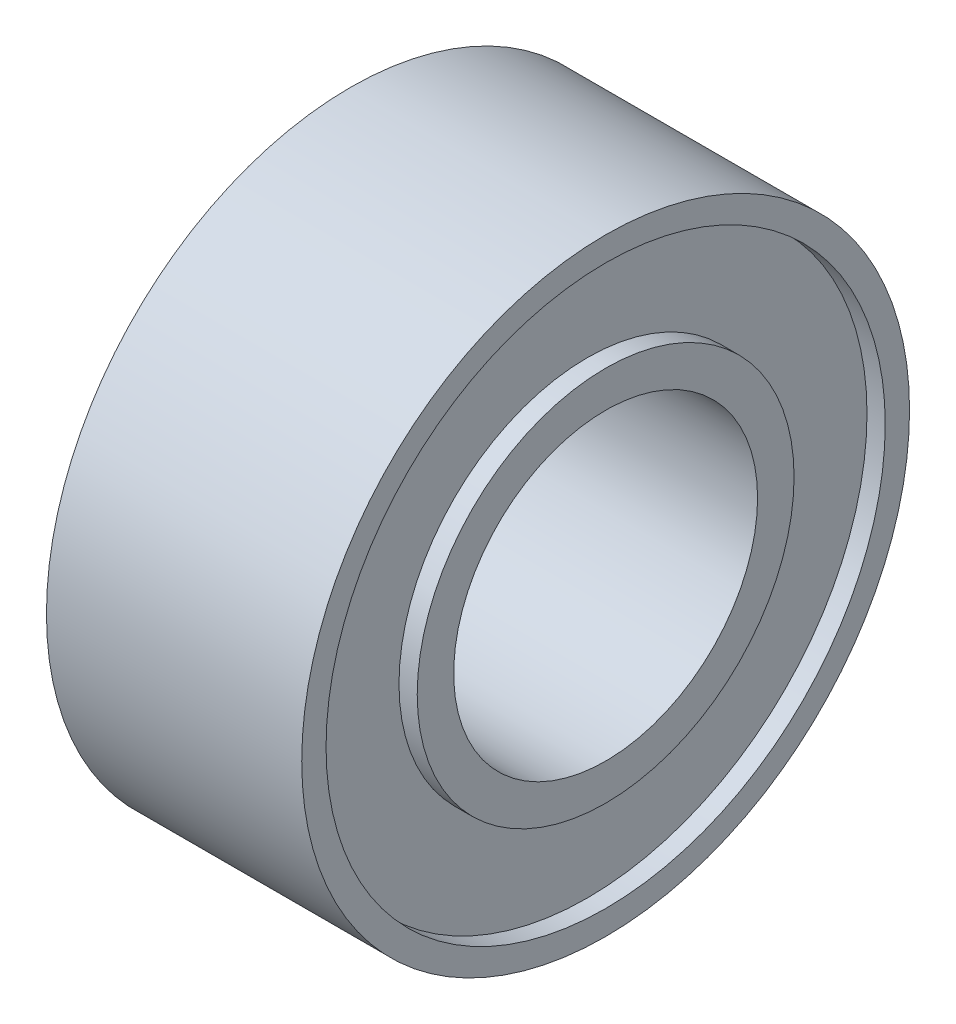
ISO-10303-21;
HEADER;
FILE_DESCRIPTION(('STEP AP214'),'2;1');
FILE_NAME('part.step','',(''),(''),'','','');
FILE_SCHEMA(('AUTOMOTIVE_DESIGN { 1 0 10303 214 1 1 1 1 }'));
ENDSEC;
DATA;
#1=APPLICATION_CONTEXT('core data for automotive mechanical design processes');
#2=APPLICATION_PROTOCOL_DEFINITION('international standard','automotive_design',2000,#1);
#3=PRODUCT_CONTEXT('',#1,'mechanical');
#4=PRODUCT('Part','Part','',(#3));
#5=PRODUCT_RELATED_PRODUCT_CATEGORY('part','',(#4));
#6=PRODUCT_DEFINITION_FORMATION('','',#4);
#7=PRODUCT_DEFINITION_CONTEXT('part definition',#1,'design');
#8=PRODUCT_DEFINITION('design','',#6,#7);
#9=PRODUCT_DEFINITION_SHAPE('','',#8);
#10=(LENGTH_UNIT() NAMED_UNIT(*) SI_UNIT(.MILLI.,.METRE.));
#11=(NAMED_UNIT(*) PLANE_ANGLE_UNIT() SI_UNIT($,.RADIAN.));
#12=(NAMED_UNIT(*) SI_UNIT($,.STERADIAN.) SOLID_ANGLE_UNIT());
#13=UNCERTAINTY_MEASURE_WITH_UNIT(LENGTH_MEASURE(1.E-05),#10,'distance_accuracy_value','');
#14=(GEOMETRIC_REPRESENTATION_CONTEXT(3) GLOBAL_UNCERTAINTY_ASSIGNED_CONTEXT((#13)) GLOBAL_UNIT_ASSIGNED_CONTEXT((#10,
#11,#12)) REPRESENTATION_CONTEXT('',''));
#15=CARTESIAN_POINT('',(0.,0.,0.));
#16=DIRECTION('',(0.,0.,1.));
#17=DIRECTION('',(1.,0.,0.));
#18=AXIS2_PLACEMENT_3D('',#15,#16,#17);
#19=CARTESIAN_POINT('',(-2.1,2.5,0.));
#20=DIRECTION('',(-1.,0.,0.));
#21=DIRECTION('',(0.,0.,1.));
#22=AXIS2_PLACEMENT_3D('',#19,#20,#21);
#23=PLANE('',#22);
#24=CARTESIAN_POINT('',(-2.1,0.,0.));
#25=DIRECTION('',(1.,0.,0.));
#26=DIRECTION('',(0.,0.,-1.));
#27=AXIS2_PLACEMENT_3D('',#24,#25,#26);
#28=CIRCLE('',#27,2.5);
#29=CARTESIAN_POINT('',(-2.1,0.,-2.5));
#30=VERTEX_POINT('',#29);
#31=EDGE_CURVE('E84',#30,#30,#28,.T.);
#32=ORIENTED_EDGE('',*,*,#31,.T.);
#33=EDGE_LOOP('',(#32));
#34=FACE_BOUND('',#33,.T.);
#35=CARTESIAN_POINT('',(-2.1,0.,0.));
#36=DIRECTION('',(1.,0.,0.));
#37=DIRECTION('',(0.,0.,-1.));
#38=AXIS2_PLACEMENT_3D('',#35,#36,#37);
#39=CIRCLE('',#38,3.1);
#40=CARTESIAN_POINT('',(-2.1,0.,-3.1));
#41=VERTEX_POINT('',#40);
#42=EDGE_CURVE('E12',#41,#41,#39,.T.);
#43=ORIENTED_EDGE('',*,*,#42,.F.);
#44=EDGE_LOOP('',(#43));
#45=FACE_BOUND('',#44,.T.);
#46=ADVANCED_FACE('F44',(#34,#45),#23,.T.);
#47=CARTESIAN_POINT('',(0.,0.,0.));
#48=DIRECTION('',(1.,0.,0.));
#49=DIRECTION('',(0.,0.,-1.));
#50=AXIS2_PLACEMENT_3D('',#47,#48,#49);
#51=CYLINDRICAL_SURFACE('',#50,3.1);
#52=ORIENTED_EDGE('',*,*,#42,.T.);
#53=EDGE_LOOP('',(#52));
#54=FACE_BOUND('',#53,.T.);
#55=CARTESIAN_POINT('',(-1.8,0.,0.));
#56=DIRECTION('',(1.,0.,0.));
#57=DIRECTION('',(0.,0.,-1.));
#58=AXIS2_PLACEMENT_3D('',#55,#56,#57);
#59=CIRCLE('',#58,3.1);
#60=CARTESIAN_POINT('',(-1.8,0.,-3.1));
#61=VERTEX_POINT('',#60);
#62=EDGE_CURVE('E50',#61,#61,#59,.T.);
#63=ORIENTED_EDGE('',*,*,#62,.F.);
#64=EDGE_LOOP('',(#63));
#65=FACE_BOUND('',#64,.T.);
#66=ADVANCED_FACE('F102',(#54,#65),#51,.T.);
#67=CARTESIAN_POINT('',(-1.8,3.1,0.));
#68=DIRECTION('',(-1.,0.,0.));
#69=DIRECTION('',(0.,0.,1.));
#70=AXIS2_PLACEMENT_3D('',#67,#68,#69);
#71=PLANE('',#70);
#72=ORIENTED_EDGE('',*,*,#62,.T.);
#73=EDGE_LOOP('',(#72));
#74=FACE_BOUND('',#73,.T.);
#75=CARTESIAN_POINT('',(-1.8,0.,0.));
#76=DIRECTION('',(1.,0.,0.));
#77=DIRECTION('',(0.,0.,-1.));
#78=AXIS2_PLACEMENT_3D('',#75,#76,#77);
#79=CIRCLE('',#78,4.6);
#80=CARTESIAN_POINT('',(-1.8,0.,-4.6));
#81=VERTEX_POINT('',#80);
#82=EDGE_CURVE('E54',#81,#81,#79,.T.);
#83=ORIENTED_EDGE('',*,*,#82,.F.);
#84=EDGE_LOOP('',(#83));
#85=FACE_BOUND('',#84,.T.);
#86=ADVANCED_FACE('F106',(#74,#85),#71,.T.);
#87=CARTESIAN_POINT('',(0.,0.,0.));
#88=DIRECTION('',(1.,0.,0.));
#89=DIRECTION('',(0.,0.,-1.));
#90=AXIS2_PLACEMENT_3D('',#87,#88,#89);
#91=CYLINDRICAL_SURFACE('',#90,4.6);
#92=ORIENTED_EDGE('',*,*,#82,.T.);
#93=EDGE_LOOP('',(#92));
#94=FACE_BOUND('',#93,.T.);
#95=CARTESIAN_POINT('',(-2.1,0.,0.));
#96=DIRECTION('',(1.,0.,0.));
#97=DIRECTION('',(0.,0.,-1.));
#98=AXIS2_PLACEMENT_3D('',#95,#96,#97);
#99=CIRCLE('',#98,4.6);
#100=CARTESIAN_POINT('',(-2.1,0.,-4.6));
#101=VERTEX_POINT('',#100);
#102=EDGE_CURVE('E58',#101,#101,#99,.T.);
#103=ORIENTED_EDGE('',*,*,#102,.F.);
#104=EDGE_LOOP('',(#103));
#105=FACE_BOUND('',#104,.T.);
#106=ADVANCED_FACE('F110',(#94,#105),#91,.F.);
#107=CARTESIAN_POINT('',(-2.1,4.6,0.));
#108=DIRECTION('',(-1.,0.,0.));
#109=DIRECTION('',(0.,0.,1.));
#110=AXIS2_PLACEMENT_3D('',#107,#108,#109);
#111=PLANE('',#110);
#112=ORIENTED_EDGE('',*,*,#102,.T.);
#113=EDGE_LOOP('',(#112));
#114=FACE_BOUND('',#113,.T.);
#115=CARTESIAN_POINT('',(-2.1,0.,0.));
#116=DIRECTION('',(1.,0.,0.));
#117=DIRECTION('',(0.,0.,-1.));
#118=AXIS2_PLACEMENT_3D('',#115,#116,#117);
#119=CIRCLE('',#118,5.);
#120=CARTESIAN_POINT('',(-2.1,0.,-5.));
#121=VERTEX_POINT('',#120);
#122=EDGE_CURVE('E63',#121,#121,#119,.T.);
#123=ORIENTED_EDGE('',*,*,#122,.F.);
#124=EDGE_LOOP('',(#123));
#125=FACE_BOUND('',#124,.T.);
#126=ADVANCED_FACE('F116',(#114,#125),#111,.T.);
#127=CARTESIAN_POINT('',(0.,0.,0.));
#128=DIRECTION('',(1.,0.,0.));
#129=DIRECTION('',(0.,0.,-1.));
#130=AXIS2_PLACEMENT_3D('',#127,#128,#129);
#131=CYLINDRICAL_SURFACE('',#130,5.);
#132=ORIENTED_EDGE('',*,*,#122,.T.);
#133=EDGE_LOOP('',(#132));
#134=FACE_BOUND('',#133,.T.);
#135=CARTESIAN_POINT('',(2.1,0.,0.));
#136=DIRECTION('',(1.,0.,0.));
#137=DIRECTION('',(0.,0.,-1.));
#138=AXIS2_PLACEMENT_3D('',#135,#136,#137);
#139=CIRCLE('',#138,5.);
#140=CARTESIAN_POINT('',(2.1,0.,-5.));
#141=VERTEX_POINT('',#140);
#142=EDGE_CURVE('E66',#141,#141,#139,.T.);
#143=ORIENTED_EDGE('',*,*,#142,.F.);
#144=EDGE_LOOP('',(#143));
#145=FACE_BOUND('',#144,.T.);
#146=ADVANCED_FACE('F120',(#134,#145),#131,.T.);
#147=CARTESIAN_POINT('',(2.1,4.6,0.));
#148=DIRECTION('',(1.,0.,0.));
#149=DIRECTION('',(0.,0.,-1.));
#150=AXIS2_PLACEMENT_3D('',#147,#148,#149);
#151=PLANE('',#150);
#152=ORIENTED_EDGE('',*,*,#142,.T.);
#153=EDGE_LOOP('',(#152));
#154=FACE_BOUND('',#153,.T.);
#155=CARTESIAN_POINT('',(2.1,0.,0.));
#156=DIRECTION('',(1.,0.,0.));
#157=DIRECTION('',(0.,0.,-1.));
#158=AXIS2_PLACEMENT_3D('',#155,#156,#157);
#159=CIRCLE('',#158,4.6);
#160=CARTESIAN_POINT('',(2.1,0.,-4.6));
#161=VERTEX_POINT('',#160);
#162=EDGE_CURVE('E69',#161,#161,#159,.T.);
#163=ORIENTED_EDGE('',*,*,#162,.F.);
#164=EDGE_LOOP('',(#163));
#165=FACE_BOUND('',#164,.T.);
#166=ADVANCED_FACE('F124',(#154,#165),#151,.T.);
#167=CARTESIAN_POINT('',(0.,0.,0.));
#168=DIRECTION('',(1.,0.,0.));
#169=DIRECTION('',(0.,0.,-1.));
#170=AXIS2_PLACEMENT_3D('',#167,#168,#169);
#171=CYLINDRICAL_SURFACE('',#170,4.6);
#172=ORIENTED_EDGE('',*,*,#162,.T.);
#173=EDGE_LOOP('',(#172));
#174=FACE_BOUND('',#173,.T.);
#175=CARTESIAN_POINT('',(1.8,0.,0.));
#176=DIRECTION('',(1.,0.,0.));
#177=DIRECTION('',(0.,0.,-1.));
#178=AXIS2_PLACEMENT_3D('',#175,#176,#177);
#179=CIRCLE('',#178,4.6);
#180=CARTESIAN_POINT('',(1.8,0.,-4.6));
#181=VERTEX_POINT('',#180);
#182=EDGE_CURVE('E72',#181,#181,#179,.T.);
#183=ORIENTED_EDGE('',*,*,#182,.F.);
#184=EDGE_LOOP('',(#183));
#185=FACE_BOUND('',#184,.T.);
#186=ADVANCED_FACE('F128',(#174,#185),#171,.F.);
#187=CARTESIAN_POINT('',(1.8,3.1,0.));
#188=DIRECTION('',(1.,0.,0.));
#189=DIRECTION('',(0.,0.,-1.));
#190=AXIS2_PLACEMENT_3D('',#187,#188,#189);
#191=PLANE('',#190);
#192=ORIENTED_EDGE('',*,*,#182,.T.);
#193=EDGE_LOOP('',(#192));
#194=FACE_BOUND('',#193,.T.);
#195=CARTESIAN_POINT('',(1.8,0.,0.));
#196=DIRECTION('',(1.,0.,0.));
#197=DIRECTION('',(0.,0.,-1.));
#198=AXIS2_PLACEMENT_3D('',#195,#196,#197);
#199=CIRCLE('',#198,3.1);
#200=CARTESIAN_POINT('',(1.8,0.,-3.1));
#201=VERTEX_POINT('',#200);
#202=EDGE_CURVE('E75',#201,#201,#199,.T.);
#203=ORIENTED_EDGE('',*,*,#202,.F.);
#204=EDGE_LOOP('',(#203));
#205=FACE_BOUND('',#204,.T.);
#206=ADVANCED_FACE('F132',(#194,#205),#191,.T.);
#207=CARTESIAN_POINT('',(0.,0.,0.));
#208=DIRECTION('',(1.,0.,0.));
#209=DIRECTION('',(0.,0.,-1.));
#210=AXIS2_PLACEMENT_3D('',#207,#208,#209);
#211=CYLINDRICAL_SURFACE('',#210,3.1);
#212=ORIENTED_EDGE('',*,*,#202,.T.);
#213=EDGE_LOOP('',(#212));
#214=FACE_BOUND('',#213,.T.);
#215=CARTESIAN_POINT('',(2.1,0.,0.));
#216=DIRECTION('',(1.,0.,0.));
#217=DIRECTION('',(0.,0.,-1.));
#218=AXIS2_PLACEMENT_3D('',#215,#216,#217);
#219=CIRCLE('',#218,3.1);
#220=CARTESIAN_POINT('',(2.1,0.,-3.1));
#221=VERTEX_POINT('',#220);
#222=EDGE_CURVE('E78',#221,#221,#219,.T.);
#223=ORIENTED_EDGE('',*,*,#222,.F.);
#224=EDGE_LOOP('',(#223));
#225=FACE_BOUND('',#224,.T.);
#226=ADVANCED_FACE('F98',(#214,#225),#211,.T.);
#227=CARTESIAN_POINT('',(2.1,2.5,0.));
#228=DIRECTION('',(1.,0.,0.));
#229=DIRECTION('',(0.,0.,-1.));
#230=AXIS2_PLACEMENT_3D('',#227,#228,#229);
#231=PLANE('',#230);
#232=ORIENTED_EDGE('',*,*,#222,.T.);
#233=EDGE_LOOP('',(#232));
#234=FACE_BOUND('',#233,.T.);
#235=CARTESIAN_POINT('',(2.1,0.,0.));
#236=DIRECTION('',(1.,0.,0.));
#237=DIRECTION('',(0.,0.,-1.));
#238=AXIS2_PLACEMENT_3D('',#235,#236,#237);
#239=CIRCLE('',#238,2.5);
#240=CARTESIAN_POINT('',(2.1,0.,-2.5));
#241=VERTEX_POINT('',#240);
#242=EDGE_CURVE('E81',#241,#241,#239,.T.);
#243=ORIENTED_EDGE('',*,*,#242,.F.);
#244=EDGE_LOOP('',(#243));
#245=FACE_BOUND('',#244,.T.);
#246=ADVANCED_FACE('F92',(#234,#245),#231,.T.);
#247=CARTESIAN_POINT('',(0.,0.,0.));
#248=DIRECTION('',(1.,0.,0.));
#249=DIRECTION('',(0.,0.,-1.));
#250=AXIS2_PLACEMENT_3D('',#247,#248,#249);
#251=CYLINDRICAL_SURFACE('',#250,2.5);
#252=ORIENTED_EDGE('',*,*,#242,.T.);
#253=EDGE_LOOP('',(#252));
#254=FACE_BOUND('',#253,.T.);
#255=ORIENTED_EDGE('',*,*,#31,.F.);
#256=EDGE_LOOP('',(#255));
#257=FACE_BOUND('',#256,.T.);
#258=ADVANCED_FACE('F90',(#254,#257),#251,.F.);
#259=CLOSED_SHELL('',(#46,#66,#86,#106,#126,#146,#166,#186,#206,#226,#246,#258));
#260=MANIFOLD_SOLID_BREP('B2',#259);
#261=ADVANCED_BREP_SHAPE_REPRESENTATION('',(#18,#260),#14);
#262=SHAPE_DEFINITION_REPRESENTATION(#9,#261);
ENDSEC;
END-ISO-10303-21;
